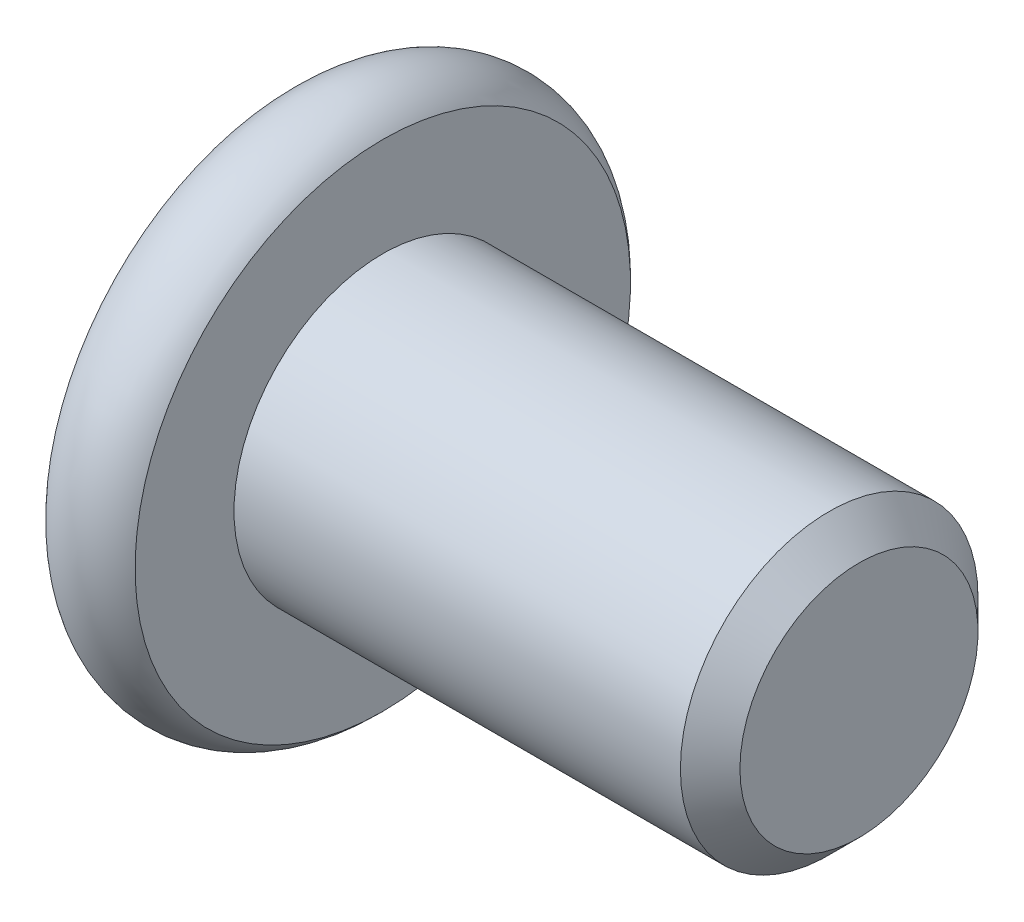
ISO-10303-21;
HEADER;
FILE_DESCRIPTION(('STEP AP214'),'2;1');
FILE_NAME('part.step','',(''),(''),'','','');
FILE_SCHEMA(('AUTOMOTIVE_DESIGN { 1 0 10303 214 1 1 1 1 }'));
ENDSEC;
DATA;
#1=APPLICATION_CONTEXT('core data for automotive mechanical design processes');
#2=APPLICATION_PROTOCOL_DEFINITION('international standard','automotive_design',2000,#1);
#3=PRODUCT_CONTEXT('',#1,'mechanical');
#4=PRODUCT('Part','Part','',(#3));
#5=PRODUCT_RELATED_PRODUCT_CATEGORY('part','',(#4));
#6=PRODUCT_DEFINITION_FORMATION('','',#4);
#7=PRODUCT_DEFINITION_CONTEXT('part definition',#1,'design');
#8=PRODUCT_DEFINITION('design','',#6,#7);
#9=PRODUCT_DEFINITION_SHAPE('','',#8);
#10=(LENGTH_UNIT() NAMED_UNIT(*) SI_UNIT(.MILLI.,.METRE.));
#11=(NAMED_UNIT(*) PLANE_ANGLE_UNIT() SI_UNIT($,.RADIAN.));
#12=(NAMED_UNIT(*) SI_UNIT($,.STERADIAN.) SOLID_ANGLE_UNIT());
#13=UNCERTAINTY_MEASURE_WITH_UNIT(LENGTH_MEASURE(1.E-05),#10,'distance_accuracy_value','');
#14=(GEOMETRIC_REPRESENTATION_CONTEXT(3) GLOBAL_UNCERTAINTY_ASSIGNED_CONTEXT((#13)) GLOBAL_UNIT_ASSIGNED_CONTEXT((#10,
#11,#12)) REPRESENTATION_CONTEXT('',''));
#15=CARTESIAN_POINT('',(0.,0.,0.));
#16=DIRECTION('',(0.,0.,1.));
#17=DIRECTION('',(1.,0.,0.));
#18=AXIS2_PLACEMENT_3D('',#15,#16,#17);
#19=CARTESIAN_POINT('',(-7.19999999999998,4.44089209850063E-13,-1.10848830114918E-12));
#20=DIRECTION('',(-1.,0.,0.));
#21=DIRECTION('',(0.,-1.,0.));
#22=AXIS2_PLACEMENT_3D('',#19,#20,#21);
#23=PLANE('',#22);
#24=DIRECTION('',(0.,-0.499999999999999,-0.866025403784439));
#25=VECTOR('',#24,1.);
#26=CARTESIAN_POINT('',(-7.20000000000001,-1.73205080756844,-2.0643209364124E-13));
#27=LINE('',#26,#25);
#28=CARTESIAN_POINT('',(-7.20000000000003,-1.73205080756865,-3.73885858353414E-13));
#29=VERTEX_POINT('',#28);
#30=CARTESIAN_POINT('',(-7.20000000000003,-0.866025403784235,1.50000000000001));
#31=VERTEX_POINT('',#30);
#32=EDGE_CURVE('E110',#29,#31,#27,.F.);
#33=ORIENTED_EDGE('',*,*,#32,.T.);
#34=DIRECTION('',(0.,-1.,0.));
#35=VECTOR('',#34,1.);
#36=CARTESIAN_POINT('',(-7.20000000000004,-0.866025403784776,1.50000000000016));
#37=LINE('',#36,#35);
#38=CARTESIAN_POINT('',(-7.2000000000001,0.866025403784646,1.49999999999963));
#39=VERTEX_POINT('',#38);
#40=EDGE_CURVE('E112',#31,#39,#37,.F.);
#41=ORIENTED_EDGE('',*,*,#40,.T.);
#42=DIRECTION('',(0.,-0.5,0.866025403784439));
#43=VECTOR('',#42,1.);
#44=CARTESIAN_POINT('',(-7.20000000000012,0.866025403784443,1.49999999999973));
#45=LINE('',#44,#43);
#46=CARTESIAN_POINT('',(-7.20000000000003,1.73205080756917,-3.90103966664779E-13));
#47=VERTEX_POINT('',#46);
#48=EDGE_CURVE('E220',#39,#47,#45,.F.);
#49=ORIENTED_EDGE('',*,*,#48,.T.);
#50=DIRECTION('',(0.,0.499999999999999,0.866025403784439));
#51=VECTOR('',#50,1.);
#52=CARTESIAN_POINT('',(-7.19999999999998,1.73205080756944,0.));
#53=LINE('',#52,#51);
#54=CARTESIAN_POINT('',(-7.20000000000005,0.866025403784743,-1.50000000000047));
#55=VERTEX_POINT('',#54);
#56=EDGE_CURVE('E67',#47,#55,#53,.F.);
#57=ORIENTED_EDGE('',*,*,#56,.T.);
#58=DIRECTION('',(0.,1.,0.));
#59=VECTOR('',#58,1.);
#60=CARTESIAN_POINT('',(-7.20000000000018,0.866025403784776,-1.50000000000049));
#61=LINE('',#60,#59);
#62=CARTESIAN_POINT('',(-7.20000000000009,-0.866025403784066,-1.50000000000063));
#63=VERTEX_POINT('',#62);
#64=EDGE_CURVE('E84',#55,#63,#61,.F.);
#65=ORIENTED_EDGE('',*,*,#64,.T.);
#66=DIRECTION('',(0.,0.5,-0.866025403784439));
#67=VECTOR('',#66,1.);
#68=CARTESIAN_POINT('',(-7.20000000000004,-0.86602540378411,-1.5000000000006));
#69=LINE('',#68,#67);
#70=EDGE_CURVE('E82',#63,#29,#69,.F.);
#71=ORIENTED_EDGE('',*,*,#70,.T.);
#72=EDGE_LOOP('',(#33,#41,#49,#57,#65,#71));
#73=FACE_BOUND('',#72,.T.);
#74=ADVANCED_FACE('F17',(#73),#23,.T.);
#75=CARTESIAN_POINT('',(-7.20000000000001,-1.73205080756844,-2.0643209364124E-13));
#76=DIRECTION('',(0.,-0.866025403784439,0.499999999999999));
#77=DIRECTION('',(0.,-0.499999999999999,-0.866025403784439));
#78=AXIS2_PLACEMENT_3D('',#75,#76,#77);
#79=PLANE('',#78);
#80=CARTESIAN_POINT('',(-9.4500000000586,-1.73205080754793,3.54742928399194E-11));
#81=CARTESIAN_POINT('',(-9.42026284964151,-1.70228509140277,0.0515557327224661));
#82=CARTESIAN_POINT('',(-9.39227250042226,-1.67202169202656,0.103973478051751));
#83=CARTESIAN_POINT('',(-9.34102336590506,-1.61031151499999,0.210858640005813));
#84=CARTESIAN_POINT('',(-9.31779308629094,-1.57885887191531,0.265336215860828));
#85=CARTESIAN_POINT('',(-9.27799946112554,-1.51543615954736,0.37518757603595));
#86=CARTESIAN_POINT('',(-9.26133612280327,-1.48348223341363,0.430533399600864));
#87=CARTESIAN_POINT('',(-9.23566307571937,-1.41887111209048,0.542443144466568));
#88=CARTESIAN_POINT('',(-9.22663421018482,-1.38621588925593,0.599003649548485));
#89=CARTESIAN_POINT('',(-9.21848741073641,-1.32993158334836,0.696490927049148));
#90=CARTESIAN_POINT('',(-9.21728188252886,-1.30637515271099,0.737291861758044));
#91=CARTESIAN_POINT('',(-9.21931613824759,-1.25930390222977,0.818821659167317));
#92=CARTESIAN_POINT('',(-9.22255690413075,-1.23578909272639,0.859550503957479));
#93=CARTESIAN_POINT('',(-9.23329730535271,-1.18898594446809,0.940615934695028));
#94=CARTESIAN_POINT('',(-9.24080090095706,-1.16569783681634,0.980952120360003));
#95=CARTESIAN_POINT('',(-9.25965947364019,-1.11951251255678,1.0609474485416));
#96=CARTESIAN_POINT('',(-9.27101610333264,-1.09661546811443,1.10060629285891));
#97=CARTESIAN_POINT('',(-9.30471857777076,-1.03798926280708,1.20214985910621));
#98=CARTESIAN_POINT('',(-9.3296009747583,-1.00262309536939,1.26340585797726));
#99=CARTESIAN_POINT('',(-9.37160371236676,-0.950621031900951,1.35347607400303));
#100=CARTESIAN_POINT('',(-9.38636063319096,-0.933484737547365,1.38315700647689));
#101=CARTESIAN_POINT('',(-9.41722149998178,-0.899527124745553,1.44197331715338));
#102=CARTESIAN_POINT('',(-9.43332480499363,-0.882705661035585,1.47110894695672));
#103=CARTESIAN_POINT('',(-9.44999996469256,-0.866025439170636,1.49999993870834));
#104=B_SPLINE_CURVE_WITH_KNOTS('',3,(#80,#81,#82,#83,#84,#85,#86,#87,#88,#89,#90,#91,#92,#93,
#94,#95,#96,#97,#98,#99,#100,#101,#102,#103),.UNSPECIFIED.,.F.,.F.,(4,2,2,2,2,2,2,2,2,2,2,4),
(0.,0.199774419659172,0.400712311775948,0.598459989991946,0.79570998551556,0.936894690704163,
1.07811058132709,1.21945787976067,1.36086588059175,1.58533905998749,1.69726358777003,
1.8091351332829),.UNSPECIFIED.);
#105=CARTESIAN_POINT('',(-9.45000000004448,-1.73205080755264,-3.68502576327392E-13));
#106=VERTEX_POINT('',#105);
#107=CARTESIAN_POINT('',(-9.4499999823861,-0.866025421477505,1.49999996935421));
#108=VERTEX_POINT('',#107);
#109=EDGE_CURVE('E20',#106,#108,#104,.T.);
#110=ORIENTED_EDGE('',*,*,#109,.T.);
#111=DIRECTION('',(1.,0.,0.));
#112=VECTOR('',#111,1.);
#113=CARTESIAN_POINT('',(-7.20000000000004,-0.866025403784332,1.50000000000016));
#114=LINE('',#113,#112);
#115=EDGE_CURVE('E116',#108,#31,#114,.T.);
#116=ORIENTED_EDGE('',*,*,#115,.T.);
#117=ORIENTED_EDGE('',*,*,#32,.F.);
#118=DIRECTION('',(1.,0.,0.));
#119=VECTOR('',#118,1.);
#120=CARTESIAN_POINT('',(-7.20000000000004,-1.73205080756869,-3.49980461278321E-13));
#121=LINE('',#120,#119);
#122=EDGE_CURVE('E99',#29,#106,#121,.F.);
#123=ORIENTED_EDGE('',*,*,#122,.T.);
#124=EDGE_LOOP('',(#110,#116,#117,#123));
#125=FACE_BOUND('',#124,.T.);
#126=ADVANCED_FACE('F173',(#125),#79,.F.);
#127=CARTESIAN_POINT('',(-7.20000000000004,-0.866025403784776,1.50000000000016));
#128=DIRECTION('',(0.,0.,1.));
#129=DIRECTION('',(0.,-1.,0.));
#130=AXIS2_PLACEMENT_3D('',#127,#128,#129);
#131=PLANE('',#130);
#132=CARTESIAN_POINT('',(-9.45000002055802,-0.866025411165569,1.49999996937614));
#133=CARTESIAN_POINT('',(-9.42026286115268,-0.806493983094441,1.49999998898084));
#134=CARTESIAN_POINT('',(-9.39227250804795,-0.74596718621657,1.49999999704134));
#135=CARTESIAN_POINT('',(-9.34102337026221,-0.622546834023855,1.5000000029762));
#136=CARTESIAN_POINT('',(-9.31779309127647,-0.559641547834231,1.50000000079096));
#137=CARTESIAN_POINT('',(-9.27799946600185,-0.432796123804386,1.49999999922191));
#138=CARTESIAN_POINT('',(-9.261336126947,-0.368888272259841,1.49999999979417));
#139=CARTESIAN_POINT('',(-9.23566307848334,-0.239666030786146,1.50000000020562));
#140=CARTESIAN_POINT('',(-9.22663421231114,-0.174355585565223,1.50000000004664));
#141=CARTESIAN_POINT('',(-9.21848741155942,-0.0617869745963884,1.49999999996688));
#142=CARTESIAN_POINT('',(-9.21728188273678,-0.0146741137333467,1.49999999999124));
#143=CARTESIAN_POINT('',(-9.21931613717412,0.0794683864659709,1.50000000000907));
#144=CARTESIAN_POINT('',(-9.22255690239027,0.126498005121342,1.50000000000255));
#145=CARTESIAN_POINT('',(-9.23329730225614,0.220104301049421,1.49999999999776));
#146=CARTESIAN_POINT('',(-9.24080089717626,0.2666805161153,1.4999999999995));
#147=CARTESIAN_POINT('',(-9.25965946851109,0.359051164207478,1.50000000000081));
#148=CARTESIAN_POINT('',(-9.27101609753943,0.404845252902913,1.50000000000036));
#149=CARTESIAN_POINT('',(-9.30471857154869,0.522097667373759,1.49999999999983));
#150=CARTESIAN_POINT('',(-9.32960096930561,0.592830006176557,1.50000000000009));
#151=CARTESIAN_POINT('',(-9.37160370861904,0.696834138739037,1.50000000000019));
#152=CARTESIAN_POINT('',(-9.38636063009315,0.731106729257393,1.50000000000017));
#153=CARTESIAN_POINT('',(-9.41722149833101,0.799021958411821,1.50000000000014));
#154=CARTESIAN_POINT('',(-9.43332480413969,0.832664887571518,1.50000000000012));
#155=CARTESIAN_POINT('',(-9.44999996469318,0.866025333013127,1.50000000000016));
#156=B_SPLINE_CURVE_WITH_KNOTS('',3,(#132,#133,#134,#135,#136,#137,#138,#139,#140,#141,#142,
#143,#144,#145,#146,#147,#148,#149,#150,#151,#152,#153,#154,#155),.UNSPECIFIED.,.F.,.F.,(4,2,2,
2,2,2,2,2,2,2,2,4),(0.,0.199774419421037,0.400712310708249,0.598459987547957,0.795709981953618,
0.936894685974462,1.07811057540664,1.21945787280995,1.3608658726085,1.5853390637883,
1.69726359732987,1.80913514857903),.UNSPECIFIED.);
#157=CARTESIAN_POINT('',(-9.44999998238572,0.866025368398888,1.49999999999977));
#158=VERTEX_POINT('',#157);
#159=EDGE_CURVE('E53',#108,#158,#156,.T.);
#160=ORIENTED_EDGE('',*,*,#159,.T.);
#161=DIRECTION('',(1.,0.,0.));
#162=VECTOR('',#161,1.);
#163=CARTESIAN_POINT('',(-7.20000000000012,0.866025403784646,1.49999999999937));
#164=LINE('',#163,#162);
#165=EDGE_CURVE('E88',#158,#39,#164,.T.);
#166=ORIENTED_EDGE('',*,*,#165,.T.);
#167=ORIENTED_EDGE('',*,*,#40,.F.);
#168=ORIENTED_EDGE('',*,*,#115,.F.);
#169=EDGE_LOOP('',(#160,#166,#167,#168));
#170=FACE_BOUND('',#169,.T.);
#171=ADVANCED_FACE('F169',(#170),#131,.F.);
#172=CARTESIAN_POINT('',(-7.20000000000012,0.866025403784443,1.49999999999973));
#173=DIRECTION('',(0.,0.866025403784439,0.5));
#174=DIRECTION('',(0.,-0.5,0.866025403784439));
#175=AXIS2_PLACEMENT_3D('',#172,#173,#174);
#176=PLANE('',#175);
#177=CARTESIAN_POINT('',(-9.45000002055597,0.86602537357374,1.49999999107966));
#178=CARTESIAN_POINT('',(-9.42026286112092,0.895791104617087,1.44844427179661));
#179=CARTESIAN_POINT('',(-9.39227250798972,0.926054510067621,1.39602653206684));
#180=CARTESIAN_POINT('',(-9.34102337016225,0.987764691367904,1.28914137457989));
#181=CARTESIAN_POINT('',(-9.31779309116127,1.01921733260343,1.23466379755734));
#182=CARTESIAN_POINT('',(-9.27799946591223,1.0826400432633,1.12481243720269));
#183=CARTESIAN_POINT('',(-9.26133612688548,1.11459396949971,1.06946661460442));
#184=CARTESIAN_POINT('',(-9.23566307846348,1.17920509052826,0.957556871071862));
#185=CARTESIAN_POINT('',(-9.22663421230495,1.21186031296789,0.900996366356011));
#186=CARTESIAN_POINT('',(-9.21848741155983,1.26814461833804,0.803509089626675));
#187=CARTESIAN_POINT('',(-9.2172818827367,1.29170104877883,0.762708155306975));
#188=CARTESIAN_POINT('',(-9.21931613716861,1.33877229887022,0.681178358608582));
#189=CARTESIAN_POINT('',(-9.22255690237977,1.36228710818036,0.640449514140073));
#190=CARTESIAN_POINT('',(-9.23329730223707,1.40909025614029,0.559384083909727));
#191=CARTESIAN_POINT('',(-9.24080089715785,1.43237836368643,0.519047898431175));
#192=CARTESIAN_POINT('',(-9.25965946849801,1.47856368775695,0.439052570579607));
#193=CARTESIAN_POINT('',(-9.27101609753116,1.50146073211588,0.39939372640589));
#194=CARTESIAN_POINT('',(-9.30471857519962,1.56008694571612,0.297850145793824));
#195=CARTESIAN_POINT('',(-9.3296009780954,1.59545312126064,0.236594132881836));
#196=CARTESIAN_POINT('',(-9.37160372650412,1.64745519638508,0.146523896667493));
#197=CARTESIAN_POINT('',(-9.38636065123201,1.66459149452277,0.116842957639325));
#198=CARTESIAN_POINT('',(-9.41722152633579,1.69854911474785,0.0580266341052948));
#199=CARTESIAN_POINT('',(-9.4333248357558,1.71537058209723,0.0288909979982721));
#200=CARTESIAN_POINT('',(-9.45000000005539,1.7320508075464,3.86863409567583E-11));
#201=B_SPLINE_CURVE_WITH_KNOTS('',3,(#177,#178,#179,#180,#181,#182,#183,#184,#185,#186,#187,
#188,#189,#190,#191,#192,#193,#194,#195,#196,#197,#198,#199,#200),.UNSPECIFIED.,.F.,.F.,(4,2,2,
2,2,2,2,2,2,2,2,4),(0.,0.199774419622929,0.40071231111159,0.598459987748434,0.795709981953104,
0.936894685903306,1.07811057526379,1.21945787273561,1.36086587260763,1.5853391034296,
1.69726365668971,1.80913522759771),.UNSPECIFIED.);
#202=CARTESIAN_POINT('',(-9.4500000002995,1.73205080762016,-4.15191723168954E-13));
#203=VERTEX_POINT('',#202);
#204=EDGE_CURVE('E39',#158,#203,#201,.T.);
#205=ORIENTED_EDGE('',*,*,#204,.T.);
#206=DIRECTION('',(1.,0.,0.));
#207=VECTOR('',#206,1.);
#208=CARTESIAN_POINT('',(-7.19999999999998,1.73205080756925,-3.42441773222563E-13));
#209=LINE('',#208,#207);
#210=EDGE_CURVE('E207',#203,#47,#209,.T.);
#211=ORIENTED_EDGE('',*,*,#210,.T.);
#212=ORIENTED_EDGE('',*,*,#48,.F.);
#213=ORIENTED_EDGE('',*,*,#165,.F.);
#214=EDGE_LOOP('',(#205,#211,#212,#213));
#215=FACE_BOUND('',#214,.T.);
#216=ADVANCED_FACE('F172',(#215),#176,.F.);
#217=CARTESIAN_POINT('',(-7.20000000000018,0.866025403784776,-1.50000000000049));
#218=DIRECTION('',(0.,0.,-1.));
#219=DIRECTION('',(0.,1.,0.));
#220=AXIS2_PLACEMENT_3D('',#217,#218,#219);
#221=PLANE('',#220);
#222=CARTESIAN_POINT('',(-9.44999996469274,0.866025333013421,-1.5000000000007));
#223=CARTESIAN_POINT('',(-9.42026281818215,0.806493904926495,-1.50000000000056));
#224=CARTESIAN_POINT('',(-9.39227247280777,0.745967110489511,-1.50000000000051));
#225=CARTESIAN_POINT('',(-9.34102334563432,0.622546765484305,-1.50000000000047));
#226=CARTESIAN_POINT('',(-9.31779306950986,0.559641484052067,-1.50000000000048));
#227=CARTESIAN_POINT('',(-9.27799945054077,0.432796069040674,-1.50000000000049));
#228=CARTESIAN_POINT('',(-9.261336114943,0.368888221752206,-1.50000000000049));
#229=CARTESIAN_POINT('',(-9.23566307221339,0.239665989383797,-1.50000000000049));
#230=CARTESIAN_POINT('',(-9.22663420831607,0.174355549011716,-1.50000000000049));
#231=CARTESIAN_POINT('',(-9.21848741022559,0.0617869427866054,-1.50000000000049));
#232=CARTESIAN_POINT('',(-9.21728188241614,0.014674081741724,-1.50000000000049));
#233=CARTESIAN_POINT('',(-9.21931613888116,-0.0794684187269317,-1.50000000000049));
#234=CARTESIAN_POINT('',(-9.22255690511273,-0.126498037469758,-1.50000000000049));
#235=CARTESIAN_POINT('',(-9.23329730696597,-0.220104333464621,-1.50000000000049));
#236=CARTESIAN_POINT('',(-9.24080090285586,-0.26668054851,-1.50000000000049));
#237=CARTESIAN_POINT('',(-9.25965947603957,-0.359051196501841,-1.50000000000049));
#238=CARTESIAN_POINT('',(-9.27101610594701,-0.404845285117407,-1.50000000000049));
#239=CARTESIAN_POINT('',(-9.304718580488,-0.522097693766626,-1.50000000000049));
#240=CARTESIAN_POINT('',(-9.32960097716295,-0.592830026988116,-1.50000000000049));
#241=CARTESIAN_POINT('',(-9.37160371404837,-0.696834151504675,-1.50000000000049));
#242=CARTESIAN_POINT('',(-9.38636063458087,-0.731106739398923,-1.50000000000049));
#243=CARTESIAN_POINT('',(-9.41722150072202,-0.799021963408346,-1.50000000000049));
#244=CARTESIAN_POINT('',(-9.433324805376,-0.83266489004695,-1.50000000000049));
#245=CARTESIAN_POINT('',(-9.44999996469114,-0.866025333008195,-1.50000000000049));
#246=B_SPLINE_CURVE_WITH_KNOTS('',3,(#222,#223,#224,#225,#226,#227,#228,#229,#230,#231,#232,
#233,#234,#235,#236,#237,#238,#239,#240,#241,#242,#243,#244,#245),.UNSPECIFIED.,.F.,.F.,(4,2,2,
2,2,2,2,2,2,2,2,4),(0.,0.199774403104775,0.400712278290946,0.59845994005854,0.795709919298113,
0.936894623766991,1.07811051367692,1.21945781148712,1.36086581169387,1.58533898613834,
1.69726351133612,1.80913505427287),.UNSPECIFIED.);
#247=CARTESIAN_POINT('',(-9.45000000360239,0.866025400260867,-1.50000000610401));
#248=VERTEX_POINT('',#247);
#249=CARTESIAN_POINT('',(-9.44999998238518,-0.866025368396025,-1.50000000000063));
#250=VERTEX_POINT('',#249);
#251=EDGE_CURVE('E95',#248,#250,#246,.T.);
#252=ORIENTED_EDGE('',*,*,#251,.T.);
#253=DIRECTION('',(1.,0.,0.));
#254=VECTOR('',#253,1.);
#255=CARTESIAN_POINT('',(-7.20000000000004,-0.866025403784007,-1.50000000000077));
#256=LINE('',#255,#254);
#257=EDGE_CURVE('E92',#250,#63,#256,.T.);
#258=ORIENTED_EDGE('',*,*,#257,.T.);
#259=ORIENTED_EDGE('',*,*,#64,.F.);
#260=DIRECTION('',(1.,0.,0.));
#261=VECTOR('',#260,1.);
#262=CARTESIAN_POINT('',(-7.19999999999998,0.866025403784743,-1.50000000000047));
#263=LINE('',#262,#261);
#264=EDGE_CURVE('E209',#55,#248,#263,.F.);
#265=ORIENTED_EDGE('',*,*,#264,.T.);
#266=EDGE_LOOP('',(#252,#258,#259,#265));
#267=FACE_BOUND('',#266,.T.);
#268=ADVANCED_FACE('F93',(#267),#221,.F.);
#269=CARTESIAN_POINT('',(-7.20000000000004,-0.86602540378411,-1.5000000000006));
#270=DIRECTION('',(0.,-0.866025403784439,-0.5));
#271=DIRECTION('',(0.,0.5,-0.866025403784439));
#272=AXIS2_PLACEMENT_3D('',#269,#270,#271);
#273=PLANE('',#272);
#274=CARTESIAN_POINT('',(-9.45000002055957,-0.866025373569917,-1.49999999108291));
#275=CARTESIAN_POINT('',(-9.42026286112386,-0.895791104614231,-1.44844427180051));
#276=CARTESIAN_POINT('',(-9.3922725079923,-0.926054510065209,-1.39602653207093));
#277=CARTESIAN_POINT('',(-9.3410233701644,-0.987764691365919,-1.28914137458395));
#278=CARTESIAN_POINT('',(-9.31779309116334,-1.01921733260143,-1.23466379756117));
#279=CARTESIAN_POINT('',(-9.2779994659141,-1.08264004326138,-1.12481243720619));
#280=CARTESIAN_POINT('',(-9.26133612688721,-1.11459396949789,-1.06946661460781));
#281=CARTESIAN_POINT('',(-9.235663078465,-1.17920509052662,-0.957556871075));
#282=CARTESIAN_POINT('',(-9.22663421230637,-1.21186031296632,-0.900996366359));
#283=CARTESIAN_POINT('',(-9.21848741156114,-1.26814461833656,-0.803509089629497));
#284=CARTESIAN_POINT('',(-9.21728188273796,-1.29170104877736,-0.762708155309782));
#285=CARTESIAN_POINT('',(-9.21931613716977,-1.33877229886877,-0.681178358611351));
#286=CARTESIAN_POINT('',(-9.22255690238088,-1.36228710817892,-0.640449514142822));
#287=CARTESIAN_POINT('',(-9.2332973022381,-1.40909025613889,-0.559384083912427));
#288=CARTESIAN_POINT('',(-9.24080089715883,-1.43237836368504,-0.519047898433847));
#289=CARTESIAN_POINT('',(-9.25965946849891,-1.47856368775559,-0.43905257058222));
#290=CARTESIAN_POINT('',(-9.27101609753203,-1.50146073211454,-0.399393726408473));
#291=CARTESIAN_POINT('',(-9.30471857520069,-1.5600869457153,-0.297850145795501));
#292=CARTESIAN_POINT('',(-9.32960097809681,-1.59545312126032,-0.236594132882664));
#293=CARTESIAN_POINT('',(-9.37160372650616,-1.64745519638546,-0.146523896667096));
#294=CARTESIAN_POINT('',(-9.38636065123428,-1.66459149452338,-0.11684295763853));
#295=CARTESIAN_POINT('',(-9.41722152633855,-1.69854911474891,-0.0580266341037179));
#296=CARTESIAN_POINT('',(-9.43332483575882,-1.71537058209852,-0.0288909979963118));
#297=CARTESIAN_POINT('',(-9.45000000005868,-1.7320508075479,-3.63489192997089E-11));
#298=B_SPLINE_CURVE_WITH_KNOTS('',3,(#274,#275,#276,#277,#278,#279,#280,#281,#282,#283,#284,
#285,#286,#287,#288,#289,#290,#291,#292,#293,#294,#295,#296,#297),.UNSPECIFIED.,.F.,.F.,(4,2,2,
2,2,2,2,2,2,2,2,4),(0.,0.199774419623539,0.400712311112788,0.598459987750149,0.795709981955347,
0.936894685905612,1.07811057526615,1.21945787273805,1.36086587261015,1.58533910343522,
1.69726365669686,1.8091352276064),.UNSPECIFIED.);
#299=EDGE_CURVE('E140',#250,#106,#298,.T.);
#300=ORIENTED_EDGE('',*,*,#299,.T.);
#301=ORIENTED_EDGE('',*,*,#122,.F.);
#302=ORIENTED_EDGE('',*,*,#70,.F.);
#303=ORIENTED_EDGE('',*,*,#257,.F.);
#304=EDGE_LOOP('',(#300,#301,#302,#303));
#305=FACE_BOUND('',#304,.T.);
#306=ADVANCED_FACE('F102',(#305),#273,.F.);
#307=CARTESIAN_POINT('',(-7.19999999999998,1.73205080756944,0.));
#308=DIRECTION('',(0.,0.866025403784439,-0.499999999999999));
#309=DIRECTION('',(0.,0.499999999999999,0.866025403784439));
#310=AXIS2_PLACEMENT_3D('',#307,#308,#309);
#311=PLANE('',#310);
#312=CARTESIAN_POINT('',(-9.45000000005918,1.73205080753952,-3.67742217116329E-11));
#313=CARTESIAN_POINT('',(-9.42026284960536,1.70228509136438,-0.0515557327854438));
#314=CARTESIAN_POINT('',(-9.39227250035455,1.67202169195407,-0.103973478177826));
#315=CARTESIAN_POINT('',(-9.34102336578849,1.61031151485453,-0.210858640261224));
#316=CARTESIAN_POINT('',(-9.31779308615712,1.57885887173097,-0.26533621618248));
#317=CARTESIAN_POINT('',(-9.27799946102204,1.51543615935885,-0.375187576364049));
#318=CARTESIAN_POINT('',(-9.26133612273254,1.48348223326219,-0.430533399865046));
#319=CARTESIAN_POINT('',(-9.23566307569718,1.41887111201499,-0.542443144599395));
#320=CARTESIAN_POINT('',(-9.22663421017851,1.38621588921932,-0.599003649613895));
#321=CARTESIAN_POINT('',(-9.21848741073756,1.32993158336473,-0.696490927022757));
#322=CARTESIAN_POINT('',(-9.21728188252931,1.30637515274119,-0.737291861707702));
#323=CARTESIAN_POINT('',(-9.21931613824141,1.25930390228771,-0.818821659068938));
#324=CARTESIAN_POINT('',(-9.22255690411862,1.23578909279823,-0.859550503835015));
#325=CARTESIAN_POINT('',(-9.23329730533029,1.18898594453998,-0.94061593457249));
#326=CARTESIAN_POINT('',(-9.24080090093523,1.16569783687465,-0.98095212026098));
#327=CARTESIAN_POINT('',(-9.25965947362424,1.11951251258802,-1.06094744848946));
#328=CARTESIAN_POINT('',(-9.27101610332215,1.09661546813219,-1.10060629283012));
#329=CARTESIAN_POINT('',(-9.30471858202192,1.03798925541095,-1.20214987191865));
#330=CARTESIAN_POINT('',(-9.32960098499471,1.00262308081836,-1.26340588318236));
#331=CARTESIAN_POINT('',(-9.37160373319657,0.950621007049959,-1.35347611704819));
#332=CARTESIAN_POINT('',(-9.3863606578105,0.933484709343625,-1.38315705532918));
#333=CARTESIAN_POINT('',(-9.41722153259817,0.899527089963472,-1.44197337739969));
#334=CARTESIAN_POINT('',(-9.43332484181622,0.882705623027694,-1.4711090127903));
#335=CARTESIAN_POINT('',(-9.45000000587831,0.866025397984944,-1.50000001004603));
#336=B_SPLINE_CURVE_WITH_KNOTS('',3,(#312,#313,#314,#315,#316,#317,#318,#319,#320,#321,#322,
#323,#324,#325,#326,#327,#328,#329,#330,#331,#332,#333,#334,#335),.UNSPECIFIED.,.F.,.F.,(4,2,2,
2,2,2,2,2,2,2,2,4),(0.,0.199774419892777,0.400712312242445,0.598459990220334,0.795709985508108,
0.936894690614094,1.07811058115317,1.21945787966624,1.36086588058259,1.58533910615113,
1.69726365690059,1.80913522531085),.UNSPECIFIED.);
#337=EDGE_CURVE('E133',#203,#248,#336,.T.);
#338=ORIENTED_EDGE('',*,*,#337,.T.);
#339=ORIENTED_EDGE('',*,*,#264,.F.);
#340=ORIENTED_EDGE('',*,*,#56,.F.);
#341=ORIENTED_EDGE('',*,*,#210,.F.);
#342=EDGE_LOOP('',(#338,#339,#340,#341));
#343=FACE_BOUND('',#342,.T.);
#344=ADVANCED_FACE('F146',(#343),#311,.F.);
#345=CARTESIAN_POINT('',(-9.50000000005956,8.88178419700125E-13,-4.37150315946176E-13));
#346=DIRECTION('',(-1.,0.,0.));
#347=DIRECTION('',(0.,-1.,0.));
#348=AXIS2_PLACEMENT_3D('',#345,#346,#347);
#349=CONICAL_SURFACE('',#348,1.78205080754967,0.785398163397451);
#350=CARTESIAN_POINT('',(-9.50000000011552,8.8817841970037E-13,-4.37150315946203E-13));
#351=DIRECTION('',(-1.,0.,0.));
#352=DIRECTION('',(0.,-1.,0.));
#353=AXIS2_PLACEMENT_3D('',#350,#351,#352);
#354=CIRCLE('',#353,1.78205080760563);
#355=CARTESIAN_POINT('',(-9.50000000011553,-1.78205080760474,-4.37150315946203E-13));
#356=VERTEX_POINT('',#355);
#357=EDGE_CURVE('E130',#356,#356,#354,.F.);
#358=ORIENTED_EDGE('',*,*,#357,.F.);
#359=EDGE_LOOP('',(#358));
#360=FACE_BOUND('',#359,.T.);
#361=ORIENTED_EDGE('',*,*,#337,.F.);
#362=ORIENTED_EDGE('',*,*,#204,.F.);
#363=ORIENTED_EDGE('',*,*,#159,.F.);
#364=ORIENTED_EDGE('',*,*,#109,.F.);
#365=ORIENTED_EDGE('',*,*,#299,.F.);
#366=ORIENTED_EDGE('',*,*,#251,.F.);
#367=EDGE_LOOP('',(#361,#362,#363,#364,#365,#366));
#368=FACE_BOUND('',#367,.T.);
#369=ADVANCED_FACE('F148',(#360,#368),#349,.F.);
#370=CARTESIAN_POINT('',(-9.50000000000023,8.88178419700125E-13,-4.37150315946155E-13));
#371=DIRECTION('',(-1.,0.,0.));
#372=DIRECTION('',(0.,-1.,0.));
#373=AXIS2_PLACEMENT_3D('',#370,#371,#372);
#374=PLANE('',#373);
#375=CARTESIAN_POINT('',(-9.50000000000023,7.76876560415715E-13,-6.80266783598387E-13));
#376=DIRECTION('',(1.,0.,0.));
#377=DIRECTION('',(0.,1.,0.));
#378=AXIS2_PLACEMENT_3D('',#375,#376,#377);
#379=CIRCLE('',#378,4.16143782776637);
#380=CARTESIAN_POINT('',(-9.50000000000023,4.16143782776714,-6.80266783598387E-13));
#381=VERTEX_POINT('',#380);
#382=EDGE_CURVE('E127',#381,#381,#379,.T.);
#383=ORIENTED_EDGE('',*,*,#382,.F.);
#384=EDGE_LOOP('',(#383));
#385=FACE_BOUND('',#384,.T.);
#386=ORIENTED_EDGE('',*,*,#357,.T.);
#387=EDGE_LOOP('',(#386));
#388=FACE_BOUND('',#387,.T.);
#389=ADVANCED_FACE('F152',(#385,#388),#374,.T.);
#390=CARTESIAN_POINT('',(-8.75000000000042,7.7715611723761E-13,-6.80011602582908E-13));
#391=DIRECTION('',(1.,0.,0.));
#392=DIRECTION('',(0.,1.,0.));
#393=AXIS2_PLACEMENT_3D('',#390,#391,#392);
#394=TOROIDAL_SURFACE('',#393,3.5,1.);
#395=ORIENTED_EDGE('',*,*,#382,.T.);
#396=EDGE_LOOP('',(#395));
#397=FACE_BOUND('',#396,.T.);
#398=CARTESIAN_POINT('',(-8.00000000000017,7.77435674059505E-13,-6.7975642156743E-13));
#399=DIRECTION('',(1.,0.,0.));
#400=DIRECTION('',(0.,1.,0.));
#401=AXIS2_PLACEMENT_3D('',#398,#399,#400);
#402=CIRCLE('',#401,4.16143782776586);
#403=CARTESIAN_POINT('',(-8.00000000000017,4.16143782776664,-6.7975642156743E-13));
#404=VERTEX_POINT('',#403);
#405=EDGE_CURVE('E124',#404,#404,#402,.T.);
#406=ORIENTED_EDGE('',*,*,#405,.F.);
#407=EDGE_LOOP('',(#406));
#408=FACE_BOUND('',#407,.T.);
#409=ADVANCED_FACE('F200',(#397,#408),#394,.T.);
#410=CARTESIAN_POINT('',(0.,0.,0.));
#411=DIRECTION('',(1.,0.,0.));
#412=DIRECTION('',(0.,0.,-1.));
#413=AXIS2_PLACEMENT_3D('',#410,#411,#412);
#414=PLANE('',#413);
#415=CARTESIAN_POINT('',(0.,0.,0.));
#416=DIRECTION('',(-1.,0.,0.));
#417=DIRECTION('',(0.,0.,1.));
#418=AXIS2_PLACEMENT_3D('',#415,#416,#417);
#419=CIRCLE('',#418,2.00000000006639);
#420=CARTESIAN_POINT('',(0.,0.,2.00000000006639));
#421=VERTEX_POINT('',#420);
#422=EDGE_CURVE('E121',#421,#421,#419,.T.);
#423=ORIENTED_EDGE('',*,*,#422,.F.);
#424=EDGE_LOOP('',(#423));
#425=FACE_BOUND('',#424,.T.);
#426=ADVANCED_FACE('F197',(#425),#414,.T.);
#427=CARTESIAN_POINT('',(-8.00000000000017,4.1614378277669,-5.89805981832114E-13));
#428=DIRECTION('',(1.,0.,0.));
#429=DIRECTION('',(0.,1.,0.));
#430=AXIS2_PLACEMENT_3D('',#427,#428,#429);
#431=PLANE('',#430);
#432=ORIENTED_EDGE('',*,*,#405,.T.);
#433=EDGE_LOOP('',(#432));
#434=FACE_BOUND('',#433,.T.);
#435=CARTESIAN_POINT('',(-8.0000000000004,3.33066907387547E-13,-3.12250225675825E-13));
#436=DIRECTION('',(1.,0.,0.));
#437=DIRECTION('',(0.,0.,-1.));
#438=AXIS2_PLACEMENT_3D('',#435,#436,#437);
#439=CIRCLE('',#438,2.50000000000001);
#440=CARTESIAN_POINT('',(-8.0000000000004,3.33066907387547E-13,-2.50000000000032));
#441=VERTEX_POINT('',#440);
#442=EDGE_CURVE('E30',#441,#441,#439,.T.);
#443=ORIENTED_EDGE('',*,*,#442,.F.);
#444=EDGE_LOOP('',(#443));
#445=FACE_BOUND('',#444,.T.);
#446=ADVANCED_FACE('F190',(#434,#445),#431,.T.);
#447=CARTESIAN_POINT('',(-0.499999999931332,0.,0.));
#448=DIRECTION('',(-1.,0.,0.));
#449=DIRECTION('',(0.,0.,1.));
#450=AXIS2_PLACEMENT_3D('',#447,#448,#449);
#451=CONICAL_SURFACE('',#450,2.49999999994088,0.785398163340605);
#452=CARTESIAN_POINT('',(-0.5,3.33029838544746E-13,-3.09698415521039E-13));
#453=DIRECTION('',(1.,0.,0.));
#454=DIRECTION('',(0.,0.,-1.));
#455=AXIS2_PLACEMENT_3D('',#452,#453,#454);
#456=CIRCLE('',#455,2.50000000000001);
#457=CARTESIAN_POINT('',(-0.5,3.33029838544746E-13,-2.50000000000032));
#458=VERTEX_POINT('',#457);
#459=EDGE_CURVE('E11',#458,#458,#456,.F.);
#460=ORIENTED_EDGE('',*,*,#459,.F.);
#461=EDGE_LOOP('',(#460));
#462=FACE_BOUND('',#461,.T.);
#463=ORIENTED_EDGE('',*,*,#422,.T.);
#464=EDGE_LOOP('',(#463));
#465=FACE_BOUND('',#464,.T.);
#466=ADVANCED_FACE('F184',(#462,#465),#451,.T.);
#467=CARTESIAN_POINT('',(-8.0000000000004,3.33066907387547E-13,-3.12250225675825E-13));
#468=DIRECTION('',(1.,0.,0.));
#469=DIRECTION('',(0.,0.,-1.));
#470=AXIS2_PLACEMENT_3D('',#467,#468,#469);
#471=CYLINDRICAL_SURFACE('',#470,2.50000000000001);
#472=ORIENTED_EDGE('',*,*,#459,.T.);
#473=EDGE_LOOP('',(#472));
#474=FACE_BOUND('',#473,.T.);
#475=ORIENTED_EDGE('',*,*,#442,.T.);
#476=EDGE_LOOP('',(#475));
#477=FACE_BOUND('',#476,.T.);
#478=ADVANCED_FACE('F182',(#474,#477),#471,.T.);
#479=CLOSED_SHELL('',(#74,#126,#171,#216,#268,#306,#344,#369,#389,#409,#426,#446,#466,#478));
#480=MANIFOLD_SOLID_BREP('B1',#479);
#481=ADVANCED_BREP_SHAPE_REPRESENTATION('',(#18,#480),#14);
#482=SHAPE_DEFINITION_REPRESENTATION(#9,#481);
ENDSEC;
END-ISO-10303-21;
